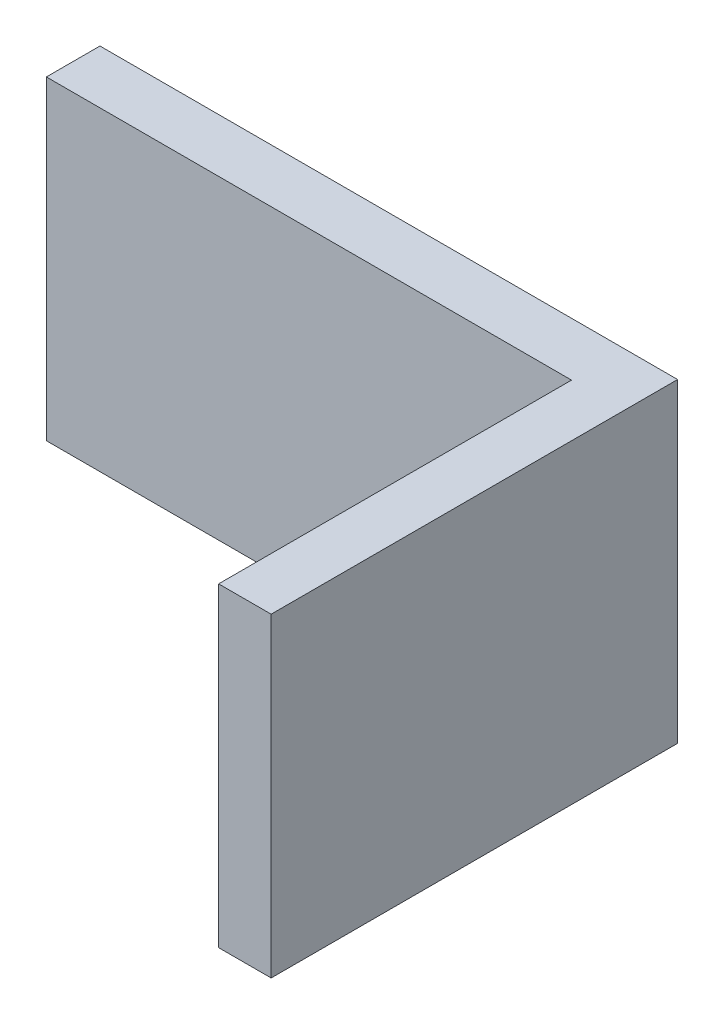
ISO-10303-21;
HEADER;
FILE_DESCRIPTION(('STEP AP214'),'2;1');
FILE_NAME('part.step','',(''),(''),'','','');
FILE_SCHEMA(('AUTOMOTIVE_DESIGN { 1 0 10303 214 1 1 1 1 }'));
ENDSEC;
DATA;
#1=APPLICATION_CONTEXT('core data for automotive mechanical design processes');
#2=APPLICATION_PROTOCOL_DEFINITION('international standard','automotive_design',2000,#1);
#3=PRODUCT_CONTEXT('',#1,'mechanical');
#4=PRODUCT('Part','Part','',(#3));
#5=PRODUCT_RELATED_PRODUCT_CATEGORY('part','',(#4));
#6=PRODUCT_DEFINITION_FORMATION('','',#4);
#7=PRODUCT_DEFINITION_CONTEXT('part definition',#1,'design');
#8=PRODUCT_DEFINITION('design','',#6,#7);
#9=PRODUCT_DEFINITION_SHAPE('','',#8);
#10=(LENGTH_UNIT() NAMED_UNIT(*) SI_UNIT(.MILLI.,.METRE.));
#11=(NAMED_UNIT(*) PLANE_ANGLE_UNIT() SI_UNIT($,.RADIAN.));
#12=(NAMED_UNIT(*) SI_UNIT($,.STERADIAN.) SOLID_ANGLE_UNIT());
#13=UNCERTAINTY_MEASURE_WITH_UNIT(LENGTH_MEASURE(1.E-05),#10,'distance_accuracy_value','');
#14=(GEOMETRIC_REPRESENTATION_CONTEXT(3) GLOBAL_UNCERTAINTY_ASSIGNED_CONTEXT((#13)) GLOBAL_UNIT_ASSIGNED_CONTEXT((#10,
#11,#12)) REPRESENTATION_CONTEXT('',''));
#15=CARTESIAN_POINT('',(0.,0.,0.));
#16=DIRECTION('',(0.,0.,1.));
#17=DIRECTION('',(1.,0.,0.));
#18=AXIS2_PLACEMENT_3D('',#15,#16,#17);
#19=CARTESIAN_POINT('',(4.55,3.9,0.));
#20=DIRECTION('',(0.,1.,0.));
#21=DIRECTION('',(0.,0.,1.));
#22=AXIS2_PLACEMENT_3D('',#19,#20,#21);
#23=PLANE('',#22);
#24=DIRECTION('',(1.,0.,0.));
#25=VECTOR('',#24,1.);
#26=CARTESIAN_POINT('',(4.,3.9,0.));
#27=LINE('',#26,#25);
#28=CARTESIAN_POINT('',(4.,3.9,0.));
#29=VERTEX_POINT('',#28);
#30=CARTESIAN_POINT('',(4.55,3.9,0.));
#31=VERTEX_POINT('',#30);
#32=EDGE_CURVE('E11',#29,#31,#27,.T.);
#33=ORIENTED_EDGE('',*,*,#32,.F.);
#34=DIRECTION('',(0.,0.,-1.));
#35=VECTOR('',#34,1.);
#36=CARTESIAN_POINT('',(4.,3.9,0.051));
#37=LINE('',#36,#35);
#38=CARTESIAN_POINT('',(4.,3.9,0.051));
#39=VERTEX_POINT('',#38);
#40=EDGE_CURVE('E24',#39,#29,#37,.T.);
#41=ORIENTED_EDGE('',*,*,#40,.F.);
#42=DIRECTION('',(-1.,0.,0.));
#43=VECTOR('',#42,1.);
#44=CARTESIAN_POINT('',(4.5,3.9,0.051));
#45=LINE('',#44,#43);
#46=CARTESIAN_POINT('',(4.5,3.9,0.051));
#47=VERTEX_POINT('',#46);
#48=EDGE_CURVE('E87',#47,#39,#45,.T.);
#49=ORIENTED_EDGE('',*,*,#48,.F.);
#50=DIRECTION('',(0.,0.,-1.));
#51=VECTOR('',#50,1.);
#52=CARTESIAN_POINT('',(4.5,3.9,0.387));
#53=LINE('',#52,#51);
#54=CARTESIAN_POINT('',(4.5,3.9,0.387));
#55=VERTEX_POINT('',#54);
#56=EDGE_CURVE('E114',#55,#47,#53,.T.);
#57=ORIENTED_EDGE('',*,*,#56,.F.);
#58=DIRECTION('',(-1.,0.,0.));
#59=VECTOR('',#58,1.);
#60=CARTESIAN_POINT('',(4.55,3.9,0.387));
#61=LINE('',#60,#59);
#62=CARTESIAN_POINT('',(4.55,3.9,0.387));
#63=VERTEX_POINT('',#62);
#64=EDGE_CURVE('E111',#63,#55,#61,.T.);
#65=ORIENTED_EDGE('',*,*,#64,.F.);
#66=DIRECTION('',(0.,0.,1.));
#67=VECTOR('',#66,1.);
#68=CARTESIAN_POINT('',(4.55,3.9,0.));
#69=LINE('',#68,#67);
#70=EDGE_CURVE('E108',#31,#63,#69,.T.);
#71=ORIENTED_EDGE('',*,*,#70,.F.);
#72=EDGE_LOOP('',(#33,#41,#49,#57,#65,#71));
#73=FACE_BOUND('',#72,.T.);
#74=ADVANCED_FACE('F17',(#73),#23,.T.);
#75=CARTESIAN_POINT('',(4.,3.6,0.));
#76=DIRECTION('',(0.,-1.,0.));
#77=DIRECTION('',(0.,0.,1.));
#78=AXIS2_PLACEMENT_3D('',#75,#76,#77);
#79=PLANE('',#78);
#80=DIRECTION('',(-1.,0.,0.));
#81=VECTOR('',#80,1.);
#82=CARTESIAN_POINT('',(4.55,3.6,0.));
#83=LINE('',#82,#81);
#84=CARTESIAN_POINT('',(4.55,3.6,0.));
#85=VERTEX_POINT('',#84);
#86=CARTESIAN_POINT('',(4.,3.6,0.));
#87=VERTEX_POINT('',#86);
#88=EDGE_CURVE('E106',#85,#87,#83,.T.);
#89=ORIENTED_EDGE('',*,*,#88,.F.);
#90=DIRECTION('',(0.,0.,-1.));
#91=VECTOR('',#90,1.);
#92=CARTESIAN_POINT('',(4.55,3.6,0.387));
#93=LINE('',#92,#91);
#94=CARTESIAN_POINT('',(4.55,3.6,0.387));
#95=VERTEX_POINT('',#94);
#96=EDGE_CURVE('E103',#95,#85,#93,.T.);
#97=ORIENTED_EDGE('',*,*,#96,.F.);
#98=DIRECTION('',(1.,0.,0.));
#99=VECTOR('',#98,1.);
#100=CARTESIAN_POINT('',(4.5,3.6,0.387));
#101=LINE('',#100,#99);
#102=CARTESIAN_POINT('',(4.5,3.6,0.387));
#103=VERTEX_POINT('',#102);
#104=EDGE_CURVE('E100',#103,#95,#101,.T.);
#105=ORIENTED_EDGE('',*,*,#104,.F.);
#106=DIRECTION('',(0.,0.,1.));
#107=VECTOR('',#106,1.);
#108=CARTESIAN_POINT('',(4.5,3.6,0.051));
#109=LINE('',#108,#107);
#110=CARTESIAN_POINT('',(4.5,3.6,0.051));
#111=VERTEX_POINT('',#110);
#112=EDGE_CURVE('E72',#111,#103,#109,.T.);
#113=ORIENTED_EDGE('',*,*,#112,.F.);
#114=DIRECTION('',(1.,0.,0.));
#115=VECTOR('',#114,1.);
#116=CARTESIAN_POINT('',(4.,3.6,0.051));
#117=LINE('',#116,#115);
#118=CARTESIAN_POINT('',(4.,3.6,0.051));
#119=VERTEX_POINT('',#118);
#120=EDGE_CURVE('E66',#119,#111,#117,.T.);
#121=ORIENTED_EDGE('',*,*,#120,.F.);
#122=DIRECTION('',(0.,0.,1.));
#123=VECTOR('',#122,1.);
#124=CARTESIAN_POINT('',(4.,3.6,0.));
#125=LINE('',#124,#123);
#126=EDGE_CURVE('E69',#87,#119,#125,.T.);
#127=ORIENTED_EDGE('',*,*,#126,.F.);
#128=EDGE_LOOP('',(#89,#97,#105,#113,#121,#127));
#129=FACE_BOUND('',#128,.T.);
#130=ADVANCED_FACE('F68',(#129),#79,.T.);
#131=CARTESIAN_POINT('',(4.55,3.9,0.387));
#132=DIRECTION('',(0.,0.,1.));
#133=DIRECTION('',(0.,1.,0.));
#134=AXIS2_PLACEMENT_3D('',#131,#132,#133);
#135=PLANE('',#134);
#136=ORIENTED_EDGE('',*,*,#64,.T.);
#137=DIRECTION('',(0.,1.,0.));
#138=VECTOR('',#137,1.);
#139=CARTESIAN_POINT('',(4.5,3.6,0.387));
#140=LINE('',#139,#138);
#141=EDGE_CURVE('E83',#103,#55,#140,.T.);
#142=ORIENTED_EDGE('',*,*,#141,.F.);
#143=ORIENTED_EDGE('',*,*,#104,.T.);
#144=DIRECTION('',(0.,-1.,0.));
#145=VECTOR('',#144,1.);
#146=CARTESIAN_POINT('',(4.55,3.9,0.387));
#147=LINE('',#146,#145);
#148=EDGE_CURVE('E88',#63,#95,#147,.T.);
#149=ORIENTED_EDGE('',*,*,#148,.F.);
#150=EDGE_LOOP('',(#136,#142,#143,#149));
#151=FACE_BOUND('',#150,.T.);
#152=ADVANCED_FACE('F125',(#151),#135,.T.);
#153=CARTESIAN_POINT('',(4.5,3.9,0.051));
#154=DIRECTION('',(0.,0.,1.));
#155=DIRECTION('',(0.,1.,0.));
#156=AXIS2_PLACEMENT_3D('',#153,#154,#155);
#157=PLANE('',#156);
#158=ORIENTED_EDGE('',*,*,#48,.T.);
#159=DIRECTION('',(0.,1.,0.));
#160=VECTOR('',#159,1.);
#161=CARTESIAN_POINT('',(4.,3.6,0.051));
#162=LINE('',#161,#160);
#163=EDGE_CURVE('E81',#119,#39,#162,.T.);
#164=ORIENTED_EDGE('',*,*,#163,.F.);
#165=ORIENTED_EDGE('',*,*,#120,.T.);
#166=DIRECTION('',(0.,-1.,0.));
#167=VECTOR('',#166,1.);
#168=CARTESIAN_POINT('',(4.5,3.9,0.051));
#169=LINE('',#168,#167);
#170=EDGE_CURVE('E89',#47,#111,#169,.T.);
#171=ORIENTED_EDGE('',*,*,#170,.F.);
#172=EDGE_LOOP('',(#158,#164,#165,#171));
#173=FACE_BOUND('',#172,.T.);
#174=ADVANCED_FACE('F86',(#173),#157,.T.);
#175=CARTESIAN_POINT('',(4.55,3.6,0.));
#176=DIRECTION('',(1.,0.,0.));
#177=DIRECTION('',(0.,0.,1.));
#178=AXIS2_PLACEMENT_3D('',#175,#176,#177);
#179=PLANE('',#178);
#180=DIRECTION('',(0.,-1.,0.));
#181=VECTOR('',#180,1.);
#182=CARTESIAN_POINT('',(4.55,3.9,0.));
#183=LINE('',#182,#181);
#184=EDGE_CURVE('E93',#31,#85,#183,.T.);
#185=ORIENTED_EDGE('',*,*,#184,.F.);
#186=ORIENTED_EDGE('',*,*,#70,.T.);
#187=ORIENTED_EDGE('',*,*,#148,.T.);
#188=ORIENTED_EDGE('',*,*,#96,.T.);
#189=EDGE_LOOP('',(#185,#186,#187,#188));
#190=FACE_BOUND('',#189,.T.);
#191=ADVANCED_FACE('F121',(#190),#179,.T.);
#192=CARTESIAN_POINT('',(4.,3.9,0.));
#193=DIRECTION('',(-1.,0.,0.));
#194=DIRECTION('',(0.,0.,1.));
#195=AXIS2_PLACEMENT_3D('',#192,#193,#194);
#196=PLANE('',#195);
#197=DIRECTION('',(0.,1.,0.));
#198=VECTOR('',#197,1.);
#199=CARTESIAN_POINT('',(4.,3.6,0.));
#200=LINE('',#199,#198);
#201=EDGE_CURVE('E82',#87,#29,#200,.T.);
#202=ORIENTED_EDGE('',*,*,#201,.F.);
#203=ORIENTED_EDGE('',*,*,#126,.T.);
#204=ORIENTED_EDGE('',*,*,#163,.T.);
#205=ORIENTED_EDGE('',*,*,#40,.T.);
#206=EDGE_LOOP('',(#202,#203,#204,#205));
#207=FACE_BOUND('',#206,.T.);
#208=ADVANCED_FACE('F80',(#207),#196,.T.);
#209=CARTESIAN_POINT('',(4.5,3.9,0.051));
#210=DIRECTION('',(-1.,0.,0.));
#211=DIRECTION('',(0.,0.,1.));
#212=AXIS2_PLACEMENT_3D('',#209,#210,#211);
#213=PLANE('',#212);
#214=ORIENTED_EDGE('',*,*,#170,.T.);
#215=ORIENTED_EDGE('',*,*,#112,.T.);
#216=ORIENTED_EDGE('',*,*,#141,.T.);
#217=ORIENTED_EDGE('',*,*,#56,.T.);
#218=EDGE_LOOP('',(#214,#215,#216,#217));
#219=FACE_BOUND('',#218,.T.);
#220=ADVANCED_FACE('F127',(#219),#213,.T.);
#221=CARTESIAN_POINT('',(4.55,3.6,0.));
#222=DIRECTION('',(0.,0.,-1.));
#223=DIRECTION('',(0.,1.,0.));
#224=AXIS2_PLACEMENT_3D('',#221,#222,#223);
#225=PLANE('',#224);
#226=ORIENTED_EDGE('',*,*,#88,.T.);
#227=ORIENTED_EDGE('',*,*,#201,.T.);
#228=ORIENTED_EDGE('',*,*,#32,.T.);
#229=ORIENTED_EDGE('',*,*,#184,.T.);
#230=EDGE_LOOP('',(#226,#227,#228,#229));
#231=FACE_BOUND('',#230,.T.);
#232=ADVANCED_FACE('F117',(#231),#225,.T.);
#233=CLOSED_SHELL('',(#74,#130,#152,#174,#191,#208,#220,#232));
#234=MANIFOLD_SOLID_BREP('B1',#233);
#235=ADVANCED_BREP_SHAPE_REPRESENTATION('',(#18,#234),#14);
#236=SHAPE_DEFINITION_REPRESENTATION(#9,#235);
ENDSEC;
END-ISO-10303-21;
